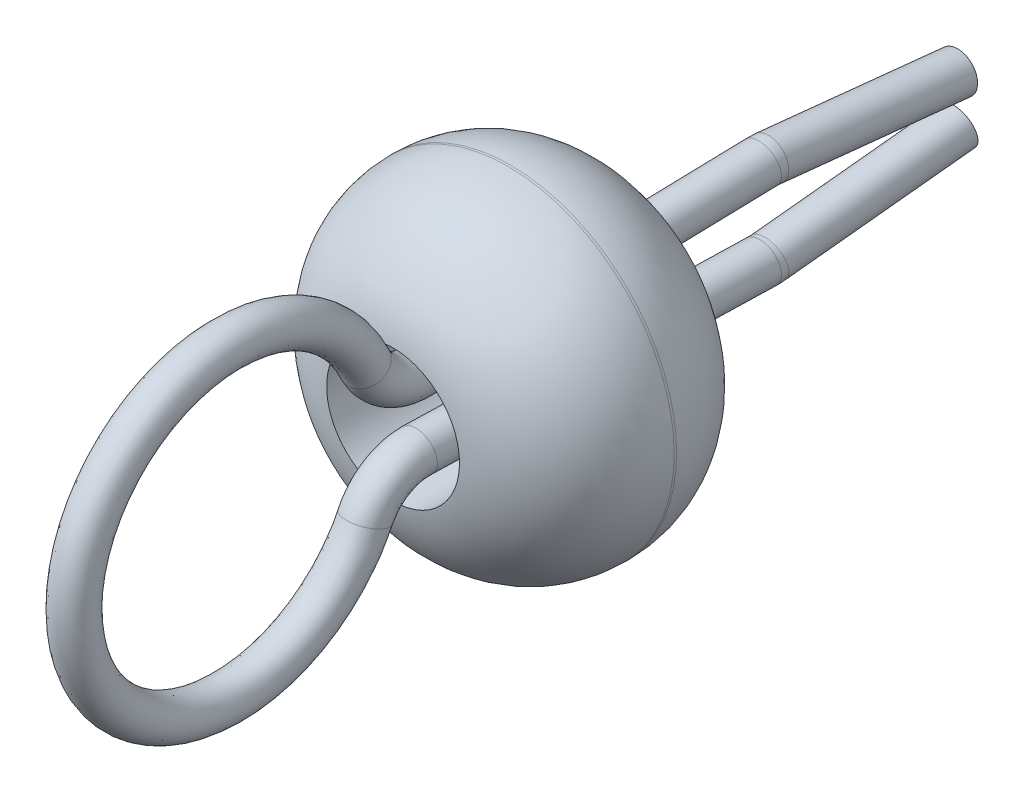
ISO-10303-21;
HEADER;
FILE_DESCRIPTION(('STEP AP214'),'2;1');
FILE_NAME('part.step','',(''),(''),'','','');
FILE_SCHEMA(('AUTOMOTIVE_DESIGN { 1 0 10303 214 1 1 1 1 }'));
ENDSEC;
DATA;
#1=APPLICATION_CONTEXT('core data for automotive mechanical design processes');
#2=APPLICATION_PROTOCOL_DEFINITION('international standard','automotive_design',2000,#1);
#3=PRODUCT_CONTEXT('',#1,'mechanical');
#4=PRODUCT('Part','Part','',(#3));
#5=PRODUCT_RELATED_PRODUCT_CATEGORY('part','',(#4));
#6=PRODUCT_DEFINITION_FORMATION('','',#4);
#7=PRODUCT_DEFINITION_CONTEXT('part definition',#1,'design');
#8=PRODUCT_DEFINITION('design','',#6,#7);
#9=PRODUCT_DEFINITION_SHAPE('','',#8);
#10=(LENGTH_UNIT() NAMED_UNIT(*) SI_UNIT(.MILLI.,.METRE.));
#11=(NAMED_UNIT(*) PLANE_ANGLE_UNIT() SI_UNIT($,.RADIAN.));
#12=(NAMED_UNIT(*) SI_UNIT($,.STERADIAN.) SOLID_ANGLE_UNIT());
#13=UNCERTAINTY_MEASURE_WITH_UNIT(LENGTH_MEASURE(1.E-05),#10,'distance_accuracy_value','');
#14=(GEOMETRIC_REPRESENTATION_CONTEXT(3) GLOBAL_UNCERTAINTY_ASSIGNED_CONTEXT((#13)) GLOBAL_UNIT_ASSIGNED_CONTEXT((#10,
#11,#12)) REPRESENTATION_CONTEXT('',''));
#15=CARTESIAN_POINT('',(0.,0.,0.));
#16=DIRECTION('',(0.,0.,1.));
#17=DIRECTION('',(1.,0.,0.));
#18=AXIS2_PLACEMENT_3D('',#15,#16,#17);
#19=CARTESIAN_POINT('',(0.,-0.327336477502774,-1.09448071747318));
#20=DIRECTION('',(0.,0.204705882352955,-0.978823529411762));
#21=DIRECTION('',(1.,0.,0.));
#22=AXIS2_PLACEMENT_3D('',#19,#20,#21);
#23=CIRCLE('',#22,0.1524);
#24=DIRECTION('',(0.,0.102899151085505,-0.994691793826551));
#25=VECTOR('',#24,1.);
#26=SURFACE_OF_LINEAR_EXTRUSION('',#23,#25);
#27=CARTESIAN_POINT('',(0.1524,-0.327336477502774,-1.09448071747318));
#28=VERTEX_POINT('',#27);
#29=EDGE_CURVE('E46',#28,#28,#23,.T.);
#30=ORIENTED_EDGE('',*,*,#29,.T.);
#31=EDGE_LOOP('',(#30));
#32=FACE_BOUND('',#31,.T.);
#33=CARTESIAN_POINT('',(0.,-0.177799999999998,-2.54000000000002));
#34=DIRECTION('',(0.,0.204705882352955,-0.978823529411762));
#35=DIRECTION('',(1.,0.,0.));
#36=AXIS2_PLACEMENT_3D('',#33,#34,#35);
#37=CIRCLE('',#36,0.1524);
#38=CARTESIAN_POINT('',(0.1524,-0.177799999999998,-2.54000000000002));
#39=VERTEX_POINT('',#38);
#40=EDGE_CURVE('E11',#39,#39,#37,.T.);
#41=ORIENTED_EDGE('',*,*,#40,.F.);
#42=EDGE_LOOP('',(#41));
#43=FACE_BOUND('',#42,.T.);
#44=ADVANCED_FACE('F40',(#32,#43),#26,.T.);
#45=CARTESIAN_POINT('',(0.,-0.329486684795185,-1.03898070701224));
#46=DIRECTION('',(0.,0.0773688039422496,-0.997002541710173));
#47=DIRECTION('',(1.,0.,0.));
#48=AXIS2_PLACEMENT_3D('',#45,#46,#47);
#49=CIRCLE('',#48,0.1524);
#50=CARTESIAN_POINT('',(0.,0.102171439071529,-1.05004886403444));
#51=DIRECTION('',(1.,0.,0.));
#52=AXIS1_PLACEMENT('',#50,#51);
#53=SURFACE_OF_REVOLUTION('',#49,#52);
#54=CARTESIAN_POINT('',(0.1524,-0.329486684795185,-1.03898070701224));
#55=VERTEX_POINT('',#54);
#56=EDGE_CURVE('E50',#55,#55,#49,.T.);
#57=ORIENTED_EDGE('',*,*,#56,.T.);
#58=EDGE_LOOP('',(#57));
#59=FACE_BOUND('',#58,.T.);
#60=ORIENTED_EDGE('',*,*,#29,.F.);
#61=EDGE_LOOP('',(#60));
#62=FACE_BOUND('',#61,.T.);
#63=ADVANCED_FACE('F61',(#59,#62),#53,.F.);
#64=CARTESIAN_POINT('',(0.,-0.262021826935956,1.5921487494977));
#65=DIRECTION('',(0.,0.0773688039422496,-0.997002541710173));
#66=DIRECTION('',(1.,0.,0.));
#67=AXIS2_PLACEMENT_3D('',#64,#65,#66);
#68=CIRCLE('',#67,0.1524);
#69=DIRECTION('',(0.,-0.0256326007925508,-0.999671430909481));
#70=VECTOR('',#69,1.);
#71=SURFACE_OF_LINEAR_EXTRUSION('',#68,#70);
#72=CARTESIAN_POINT('',(0.1524,-0.262021826935956,1.5921487494977));
#73=VERTEX_POINT('',#72);
#74=EDGE_CURVE('E54',#73,#73,#68,.T.);
#75=ORIENTED_EDGE('',*,*,#74,.T.);
#76=EDGE_LOOP('',(#75));
#77=FACE_BOUND('',#76,.T.);
#78=ORIENTED_EDGE('',*,*,#56,.F.);
#79=EDGE_LOOP('',(#78));
#80=FACE_BOUND('',#79,.T.);
#81=ADVANCED_FACE('F64',(#77,#80),#71,.T.);
#82=CARTESIAN_POINT('',(0.,-0.506786371505022,1.99247521409643));
#83=DIRECTION('',(0.,0.941230279940282,-0.337765540165863));
#84=DIRECTION('',(1.,0.,0.));
#85=AXIS2_PLACEMENT_3D('',#82,#83,#84);
#86=CIRCLE('',#85,0.1524);
#87=CARTESIAN_POINT('',(0.,-0.69367995080267,1.60321690651994));
#88=DIRECTION('',(-1.,0.,0.));
#89=AXIS1_PLACEMENT('',#87,#88);
#90=SURFACE_OF_REVOLUTION('',#86,#89);
#91=CARTESIAN_POINT('',(0.1524,-0.506786371505022,1.99247521409643));
#92=VERTEX_POINT('',#91);
#93=EDGE_CURVE('E76',#92,#92,#86,.T.);
#94=ORIENTED_EDGE('',*,*,#93,.T.);
#95=EDGE_LOOP('',(#94));
#96=FACE_BOUND('',#95,.T.);
#97=ORIENTED_EDGE('',*,*,#74,.F.);
#98=EDGE_LOOP('',(#97));
#99=FACE_BOUND('',#98,.T.);
#100=ADVANCED_FACE('F68',(#96,#99),#90,.F.);
#101=CARTESIAN_POINT('',(0.,0.506786371505037,1.99247521409644));
#102=DIRECTION('',(0.,0.852155751672292,0.523288233091315));
#103=DIRECTION('',(1.,0.,0.));
#104=AXIS2_PLACEMENT_3D('',#101,#102,#103);
#105=CIRCLE('',#104,0.1524);
#106=CARTESIAN_POINT('',(0.,0.,3.048));
#107=DIRECTION('',(1.,0.,0.));
#108=AXIS1_PLACEMENT('',#106,#107);
#109=SURFACE_OF_REVOLUTION('',#105,#108);
#110=CARTESIAN_POINT('',(0.1524,0.506786371505037,1.99247521409644));
#111=VERTEX_POINT('',#110);
#112=EDGE_CURVE('E79',#111,#111,#105,.T.);
#113=ORIENTED_EDGE('',*,*,#112,.T.);
#114=EDGE_LOOP('',(#113));
#115=FACE_BOUND('',#114,.T.);
#116=ORIENTED_EDGE('',*,*,#93,.F.);
#117=EDGE_LOOP('',(#116));
#118=FACE_BOUND('',#117,.T.);
#119=ADVANCED_FACE('F72',(#115,#118),#109,.F.);
#120=CARTESIAN_POINT('',(0.,0.262021826935956,1.59214874949772));
#121=DIRECTION('',(0.,-0.1283618792678,0.99172739598684));
#122=DIRECTION('',(1.,0.,0.));
#123=AXIS2_PLACEMENT_3D('',#120,#121,#122);
#124=CIRCLE('',#123,0.1524);
#125=CARTESIAN_POINT('',(0.,0.69367995080267,1.60321690651994));
#126=DIRECTION('',(-1.,0.,0.));
#127=AXIS1_PLACEMENT('',#125,#126);
#128=SURFACE_OF_REVOLUTION('',#124,#127);
#129=CARTESIAN_POINT('',(0.1524,0.262021826935956,1.59214874949772));
#130=VERTEX_POINT('',#129);
#131=EDGE_CURVE('E83',#130,#130,#124,.T.);
#132=ORIENTED_EDGE('',*,*,#131,.T.);
#133=EDGE_LOOP('',(#132));
#134=FACE_BOUND('',#133,.T.);
#135=ORIENTED_EDGE('',*,*,#112,.F.);
#136=EDGE_LOOP('',(#135));
#137=FACE_BOUND('',#136,.T.);
#138=ADVANCED_FACE('F90',(#134,#137),#128,.F.);
#139=CARTESIAN_POINT('',(0.,0.329486684795185,-1.03898070701222));
#140=DIRECTION('',(0.,-0.1283618792678,0.99172739598684));
#141=DIRECTION('',(1.,0.,0.));
#142=AXIS2_PLACEMENT_3D('',#139,#140,#141);
#143=CIRCLE('',#142,0.1524);
#144=DIRECTION('',(0.,-0.0256326007925508,0.999671430909481));
#145=VECTOR('',#144,1.);
#146=SURFACE_OF_LINEAR_EXTRUSION('',#143,#145);
#147=CARTESIAN_POINT('',(0.1524,0.329486684795185,-1.03898070701222));
#148=VERTEX_POINT('',#147);
#149=EDGE_CURVE('E87',#148,#148,#143,.T.);
#150=ORIENTED_EDGE('',*,*,#149,.T.);
#151=EDGE_LOOP('',(#150));
#152=FACE_BOUND('',#151,.T.);
#153=ORIENTED_EDGE('',*,*,#131,.F.);
#154=EDGE_LOOP('',(#153));
#155=FACE_BOUND('',#154,.T.);
#156=ADVANCED_FACE('F93',(#152,#155),#146,.T.);
#157=CARTESIAN_POINT('',(0.,0.327336477502776,-1.09448071747316));
#158=DIRECTION('',(0.,0.,1.));
#159=DIRECTION('',(1.,0.,0.));
#160=AXIS2_PLACEMENT_3D('',#157,#158,#159);
#161=CIRCLE('',#160,0.1524);
#162=CARTESIAN_POINT('',(0.,-0.102171439071529,-1.05004886403444));
#163=DIRECTION('',(1.,0.,0.));
#164=AXIS1_PLACEMENT('',#162,#163);
#165=SURFACE_OF_REVOLUTION('',#161,#164);
#166=CARTESIAN_POINT('',(0.1524,0.327336477502776,-1.09448071747316));
#167=VERTEX_POINT('',#166);
#168=EDGE_CURVE('E105',#167,#167,#161,.T.);
#169=ORIENTED_EDGE('',*,*,#168,.T.);
#170=EDGE_LOOP('',(#169));
#171=FACE_BOUND('',#170,.T.);
#172=ORIENTED_EDGE('',*,*,#149,.F.);
#173=EDGE_LOOP('',(#172));
#174=FACE_BOUND('',#173,.T.);
#175=ADVANCED_FACE('F97',(#171,#174),#165,.F.);
#176=DIRECTION('',(0.,-0.102899151085505,-0.994691793826551));
#177=VECTOR('',#176,1.);
#178=SURFACE_OF_LINEAR_EXTRUSION('',#161,#177);
#179=ORIENTED_EDGE('',*,*,#168,.F.);
#180=EDGE_LOOP('',(#179));
#181=FACE_BOUND('',#180,.T.);
#182=CARTESIAN_POINT('',(0.,0.1778,-2.54));
#183=DIRECTION('',(0.,0.,1.));
#184=DIRECTION('',(1.,0.,0.));
#185=AXIS2_PLACEMENT_3D('',#182,#183,#184);
#186=CIRCLE('',#185,0.1524);
#187=CARTESIAN_POINT('',(0.1524,0.1778,-2.54));
#188=VERTEX_POINT('',#187);
#189=EDGE_CURVE('E108',#188,#188,#186,.T.);
#190=ORIENTED_EDGE('',*,*,#189,.T.);
#191=EDGE_LOOP('',(#190));
#192=FACE_BOUND('',#191,.T.);
#193=ADVANCED_FACE('F102',(#181,#192),#178,.F.);
#194=CARTESIAN_POINT('',(0.,-0.177799999999998,-2.54000000000002));
#195=DIRECTION('',(0.,0.204705882352955,-0.978823529411762));
#196=DIRECTION('',(1.,0.,0.));
#197=AXIS2_PLACEMENT_3D('',#194,#195,#196);
#198=PLANE('',#197);
#199=ORIENTED_EDGE('',*,*,#40,.T.);
#200=EDGE_LOOP('',(#199));
#201=FACE_BOUND('',#200,.T.);
#202=ADVANCED_FACE('F116',(#201),#198,.T.);
#203=CARTESIAN_POINT('',(0.,0.1778,-2.54));
#204=DIRECTION('',(0.,0.,1.));
#205=DIRECTION('',(1.,0.,0.));
#206=AXIS2_PLACEMENT_3D('',#203,#204,#205);
#207=PLANE('',#206);
#208=ORIENTED_EDGE('',*,*,#189,.F.);
#209=EDGE_LOOP('',(#208));
#210=FACE_BOUND('',#209,.T.);
#211=ADVANCED_FACE('F114',(#210),#207,.F.);
#212=CLOSED_SHELL('',(#44,#63,#81,#100,#119,#138,#156,#175,#193,#202,#211));
#213=MANIFOLD_SOLID_BREP('B2',#212);
#214=CARTESIAN_POINT('',(0.,0.,1.778));
#215=DIRECTION('',(0.,0.,-1.));
#216=DIRECTION('',(-1.,0.,0.));
#217=AXIS2_PLACEMENT_3D('',#214,#215,#216);
#218=CYLINDRICAL_SURFACE('',#217,1.27);
#219=CARTESIAN_POINT('',(0.,0.,0.87988181024499));
#220=DIRECTION('',(0.,0.,-1.));
#221=DIRECTION('',(-1.,0.,0.));
#222=AXIS2_PLACEMENT_3D('',#219,#220,#221);
#223=CIRCLE('',#222,1.27);
#224=CARTESIAN_POINT('',(-1.27,0.,0.87988181024499));
#225=VERTEX_POINT('',#224);
#226=EDGE_CURVE('E39',#225,#225,#223,.F.);
#227=ORIENTED_EDGE('',*,*,#226,.T.);
#228=EDGE_LOOP('',(#227));
#229=FACE_BOUND('',#228,.T.);
#230=CARTESIAN_POINT('',(0.,0.,0.89811818975501));
#231=DIRECTION('',(0.,0.,1.));
#232=DIRECTION('',(1.,0.,0.));
#233=AXIS2_PLACEMENT_3D('',#230,#231,#232);
#234=CIRCLE('',#233,1.27);
#235=CARTESIAN_POINT('',(1.27,0.,0.89811818975501));
#236=VERTEX_POINT('',#235);
#237=EDGE_CURVE('E216',#236,#236,#234,.F.);
#238=ORIENTED_EDGE('',*,*,#237,.T.);
#239=EDGE_LOOP('',(#238));
#240=FACE_BOUND('',#239,.T.);
#241=ADVANCED_FACE('F209',(#229,#240),#218,.T.);
#242=CARTESIAN_POINT('',(0.,0.,1.778));
#243=DIRECTION('',(0.,0.,-1.));
#244=DIRECTION('',(-1.,0.,0.));
#245=AXIS2_PLACEMENT_3D('',#242,#243,#244);
#246=CYLINDRICAL_SURFACE('',#245,0.508);
#247=CARTESIAN_POINT('',(0.,0.,1.778));
#248=DIRECTION('',(0.,0.,1.));
#249=DIRECTION('',(1.,0.,0.));
#250=AXIS2_PLACEMENT_3D('',#247,#248,#249);
#251=CIRCLE('',#250,0.508);
#252=CARTESIAN_POINT('',(0.508,0.,1.778));
#253=VERTEX_POINT('',#252);
#254=EDGE_CURVE('E220',#253,#253,#251,.T.);
#255=ORIENTED_EDGE('',*,*,#254,.T.);
#256=EDGE_LOOP('',(#255));
#257=FACE_BOUND('',#256,.T.);
#258=CARTESIAN_POINT('',(0.,0.,0.));
#259=DIRECTION('',(0.,0.,1.));
#260=DIRECTION('',(1.,0.,0.));
#261=AXIS2_PLACEMENT_3D('',#258,#259,#260);
#262=CIRCLE('',#261,0.508);
#263=CARTESIAN_POINT('',(0.508,0.,0.));
#264=VERTEX_POINT('',#263);
#265=EDGE_CURVE('E224',#264,#264,#262,.T.);
#266=ORIENTED_EDGE('',*,*,#265,.F.);
#267=EDGE_LOOP('',(#266));
#268=FACE_BOUND('',#267,.T.);
#269=ADVANCED_FACE('F233',(#257,#268),#246,.F.);
#270=CARTESIAN_POINT('',(0.,0.,0.87988181024499));
#271=DIRECTION('',(0.,0.,-1.));
#272=DIRECTION('',(-1.,0.,0.));
#273=AXIS2_PLACEMENT_3D('',#270,#271,#272);
#274=DEGENERATE_TOROIDAL_SURFACE('',#273,0.381000000000001,0.889,.T.);
#275=ORIENTED_EDGE('',*,*,#265,.T.);
#276=EDGE_LOOP('',(#275));
#277=FACE_BOUND('',#276,.T.);
#278=ORIENTED_EDGE('',*,*,#226,.F.);
#279=EDGE_LOOP('',(#278));
#280=FACE_BOUND('',#279,.T.);
#281=ADVANCED_FACE('F230',(#277,#280),#274,.T.);
#282=CARTESIAN_POINT('',(0.,0.,0.89811818975501));
#283=DIRECTION('',(0.,0.,1.));
#284=DIRECTION('',(1.,0.,0.));
#285=AXIS2_PLACEMENT_3D('',#282,#283,#284);
#286=DEGENERATE_TOROIDAL_SURFACE('',#285,0.381000000000001,0.889,.T.);
#287=ORIENTED_EDGE('',*,*,#237,.F.);
#288=EDGE_LOOP('',(#287));
#289=FACE_BOUND('',#288,.T.);
#290=ORIENTED_EDGE('',*,*,#254,.F.);
#291=EDGE_LOOP('',(#290));
#292=FACE_BOUND('',#291,.T.);
#293=ADVANCED_FACE('F211',(#289,#292),#286,.T.);
#294=CLOSED_SHELL('',(#241,#269,#281,#293));
#295=MANIFOLD_SOLID_BREP('B6',#294);
#296=ADVANCED_BREP_SHAPE_REPRESENTATION('',(#18,#213,#295),#14);
#297=SHAPE_DEFINITION_REPRESENTATION(#9,#296);
ENDSEC;
END-ISO-10303-21;
